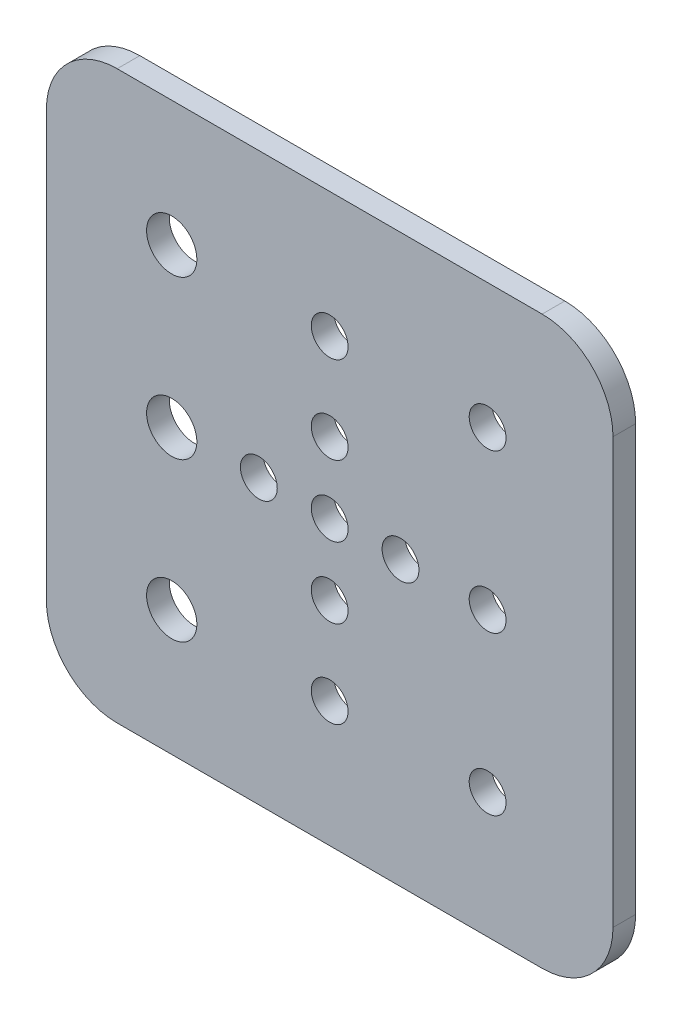
ISO-10303-21;
HEADER;
FILE_DESCRIPTION(('STEP AP214'),'2;1');
FILE_NAME('part.step','',(''),(''),'','','');
FILE_SCHEMA(('AUTOMOTIVE_DESIGN { 1 0 10303 214 1 1 1 1 }'));
ENDSEC;
DATA;
#1=APPLICATION_CONTEXT('core data for automotive mechanical design processes');
#2=APPLICATION_PROTOCOL_DEFINITION('international standard','automotive_design',2000,#1);
#3=PRODUCT_CONTEXT('',#1,'mechanical');
#4=PRODUCT('Part','Part','',(#3));
#5=PRODUCT_RELATED_PRODUCT_CATEGORY('part','',(#4));
#6=PRODUCT_DEFINITION_FORMATION('','',#4);
#7=PRODUCT_DEFINITION_CONTEXT('part definition',#1,'design');
#8=PRODUCT_DEFINITION('design','',#6,#7);
#9=PRODUCT_DEFINITION_SHAPE('','',#8);
#10=(LENGTH_UNIT() NAMED_UNIT(*) SI_UNIT(.MILLI.,.METRE.));
#11=(NAMED_UNIT(*) PLANE_ANGLE_UNIT() SI_UNIT($,.RADIAN.));
#12=(NAMED_UNIT(*) SI_UNIT($,.STERADIAN.) SOLID_ANGLE_UNIT());
#13=UNCERTAINTY_MEASURE_WITH_UNIT(LENGTH_MEASURE(1.E-05),#10,'distance_accuracy_value','');
#14=(GEOMETRIC_REPRESENTATION_CONTEXT(3) GLOBAL_UNCERTAINTY_ASSIGNED_CONTEXT((#13)) GLOBAL_UNIT_ASSIGNED_CONTEXT((#10,
#11,#12)) REPRESENTATION_CONTEXT('',''));
#15=CARTESIAN_POINT('',(0.,0.,0.));
#16=DIRECTION('',(0.,0.,1.));
#17=DIRECTION('',(1.,0.,0.));
#18=AXIS2_PLACEMENT_3D('',#15,#16,#17);
#19=CARTESIAN_POINT('',(0.,0.,3.2));
#20=DIRECTION('',(0.,0.,1.));
#21=DIRECTION('',(1.,0.,0.));
#22=AXIS2_PLACEMENT_3D('',#19,#20,#21);
#23=PLANE('',#22);
#24=CARTESIAN_POINT('',(-22.3,-22.3,3.2));
#25=DIRECTION('',(0.,0.,1.));
#26=DIRECTION('',(1.,0.,0.));
#27=AXIS2_PLACEMENT_3D('',#24,#25,#26);
#28=CIRCLE('',#27,3.55);
#29=CARTESIAN_POINT('',(-18.75,-22.3,3.2));
#30=VERTEX_POINT('',#29);
#31=EDGE_CURVE('E235',#30,#30,#28,.T.);
#32=ORIENTED_EDGE('',*,*,#31,.F.);
#33=EDGE_LOOP('',(#32));
#34=FACE_BOUND('',#33,.T.);
#35=CARTESIAN_POINT('',(22.3,22.3,3.2));
#36=DIRECTION('',(0.,0.,1.));
#37=DIRECTION('',(1.,0.,0.));
#38=AXIS2_PLACEMENT_3D('',#35,#36,#37);
#39=CIRCLE('',#38,2.6);
#40=CARTESIAN_POINT('',(24.9,22.3,3.2));
#41=VERTEX_POINT('',#40);
#42=EDGE_CURVE('E223',#41,#41,#39,.T.);
#43=ORIENTED_EDGE('',*,*,#42,.F.);
#44=EDGE_LOOP('',(#43));
#45=FACE_BOUND('',#44,.T.);
#46=CARTESIAN_POINT('',(-22.3,0.,3.2));
#47=DIRECTION('',(0.,0.,1.));
#48=DIRECTION('',(1.,0.,0.));
#49=AXIS2_PLACEMENT_3D('',#46,#47,#48);
#50=CIRCLE('',#49,3.55);
#51=CARTESIAN_POINT('',(-18.75,0.,3.2));
#52=VERTEX_POINT('',#51);
#53=EDGE_CURVE('E211',#52,#52,#50,.T.);
#54=ORIENTED_EDGE('',*,*,#53,.F.);
#55=EDGE_LOOP('',(#54));
#56=FACE_BOUND('',#55,.T.);
#57=CARTESIAN_POINT('',(10.,0.,3.2));
#58=DIRECTION('',(0.,0.,1.));
#59=DIRECTION('',(1.,0.,0.));
#60=AXIS2_PLACEMENT_3D('',#57,#58,#59);
#61=CIRCLE('',#60,2.6);
#62=CARTESIAN_POINT('',(12.6,0.,3.2));
#63=VERTEX_POINT('',#62);
#64=EDGE_CURVE('E199',#63,#63,#61,.T.);
#65=ORIENTED_EDGE('',*,*,#64,.F.);
#66=EDGE_LOOP('',(#65));
#67=FACE_BOUND('',#66,.T.);
#68=CARTESIAN_POINT('',(0.,-10.,3.2));
#69=DIRECTION('',(0.,0.,1.));
#70=DIRECTION('',(1.,0.,0.));
#71=AXIS2_PLACEMENT_3D('',#68,#69,#70);
#72=CIRCLE('',#71,2.6);
#73=CARTESIAN_POINT('',(2.60000000000001,-10.,3.2));
#74=VERTEX_POINT('',#73);
#75=EDGE_CURVE('E187',#74,#74,#72,.T.);
#76=ORIENTED_EDGE('',*,*,#75,.F.);
#77=EDGE_LOOP('',(#76));
#78=FACE_BOUND('',#77,.T.);
#79=CARTESIAN_POINT('',(0.,10.,3.2));
#80=DIRECTION('',(0.,0.,1.));
#81=DIRECTION('',(1.,0.,0.));
#82=AXIS2_PLACEMENT_3D('',#79,#80,#81);
#83=CIRCLE('',#82,2.6);
#84=CARTESIAN_POINT('',(2.6,10.,3.2));
#85=VERTEX_POINT('',#84);
#86=EDGE_CURVE('E176',#85,#85,#83,.T.);
#87=ORIENTED_EDGE('',*,*,#86,.F.);
#88=EDGE_LOOP('',(#87));
#89=FACE_BOUND('',#88,.T.);
#90=DIRECTION('',(0.,-1.,0.));
#91=VECTOR('',#90,1.);
#92=CARTESIAN_POINT('',(-40.,40.,3.2));
#93=LINE('',#92,#91);
#94=CARTESIAN_POINT('',(-40.,30.,3.2));
#95=VERTEX_POINT('',#94);
#96=CARTESIAN_POINT('',(-40.,-30.,3.2));
#97=VERTEX_POINT('',#96);
#98=EDGE_CURVE('E171',#95,#97,#93,.T.);
#99=ORIENTED_EDGE('',*,*,#98,.T.);
#100=CARTESIAN_POINT('',(-30.,-30.,3.2));
#101=DIRECTION('',(0.,0.,1.));
#102=DIRECTION('',(1.,0.,0.));
#103=AXIS2_PLACEMENT_3D('',#100,#101,#102);
#104=CIRCLE('',#103,10.);
#105=CARTESIAN_POINT('',(-30.,-40.,3.2));
#106=VERTEX_POINT('',#105);
#107=EDGE_CURVE('E148',#97,#106,#104,.T.);
#108=ORIENTED_EDGE('',*,*,#107,.T.);
#109=DIRECTION('',(1.,0.,0.));
#110=VECTOR('',#109,1.);
#111=CARTESIAN_POINT('',(-40.,-40.,3.2));
#112=LINE('',#111,#110);
#113=CARTESIAN_POINT('',(30.,-40.,3.2));
#114=VERTEX_POINT('',#113);
#115=EDGE_CURVE('E119',#106,#114,#112,.T.);
#116=ORIENTED_EDGE('',*,*,#115,.T.);
#117=CARTESIAN_POINT('',(30.,-30.,3.2));
#118=DIRECTION('',(0.,0.,1.));
#119=DIRECTION('',(1.,0.,0.));
#120=AXIS2_PLACEMENT_3D('',#117,#118,#119);
#121=CIRCLE('',#120,10.);
#122=CARTESIAN_POINT('',(40.,-30.,3.2));
#123=VERTEX_POINT('',#122);
#124=EDGE_CURVE('E146',#114,#123,#121,.T.);
#125=ORIENTED_EDGE('',*,*,#124,.T.);
#126=DIRECTION('',(0.,1.,0.));
#127=VECTOR('',#126,1.);
#128=CARTESIAN_POINT('',(40.,40.,3.2));
#129=LINE('',#128,#127);
#130=CARTESIAN_POINT('',(40.,30.,3.2));
#131=VERTEX_POINT('',#130);
#132=EDGE_CURVE('E126',#123,#131,#129,.T.);
#133=ORIENTED_EDGE('',*,*,#132,.T.);
#134=CARTESIAN_POINT('',(30.,30.,3.2));
#135=DIRECTION('',(0.,0.,1.));
#136=DIRECTION('',(1.,0.,0.));
#137=AXIS2_PLACEMENT_3D('',#134,#135,#136);
#138=CIRCLE('',#137,10.);
#139=CARTESIAN_POINT('',(30.,40.,3.2));
#140=VERTEX_POINT('',#139);
#141=EDGE_CURVE('E54',#131,#140,#138,.T.);
#142=ORIENTED_EDGE('',*,*,#141,.T.);
#143=DIRECTION('',(-1.,0.,0.));
#144=VECTOR('',#143,1.);
#145=CARTESIAN_POINT('',(-40.,40.,3.2));
#146=LINE('',#145,#144);
#147=CARTESIAN_POINT('',(-30.,40.,3.2));
#148=VERTEX_POINT('',#147);
#149=EDGE_CURVE('E129',#140,#148,#146,.T.);
#150=ORIENTED_EDGE('',*,*,#149,.T.);
#151=CARTESIAN_POINT('',(-30.,30.,3.2));
#152=DIRECTION('',(0.,0.,1.));
#153=DIRECTION('',(1.,0.,0.));
#154=AXIS2_PLACEMENT_3D('',#151,#152,#153);
#155=CIRCLE('',#154,10.);
#156=EDGE_CURVE('E143',#148,#95,#155,.T.);
#157=ORIENTED_EDGE('',*,*,#156,.T.);
#158=EDGE_LOOP('',(#99,#108,#116,#125,#133,#142,#150,#157));
#159=FACE_BOUND('',#158,.T.);
#160=CARTESIAN_POINT('',(0.,0.,3.2));
#161=DIRECTION('',(0.,0.,1.));
#162=DIRECTION('',(1.,0.,0.));
#163=AXIS2_PLACEMENT_3D('',#160,#161,#162);
#164=CIRCLE('',#163,2.6);
#165=CARTESIAN_POINT('',(2.59999999999999,0.,3.2));
#166=VERTEX_POINT('',#165);
#167=EDGE_CURVE('E164',#166,#166,#164,.T.);
#168=ORIENTED_EDGE('',*,*,#167,.F.);
#169=EDGE_LOOP('',(#168));
#170=FACE_BOUND('',#169,.T.);
#171=CARTESIAN_POINT('',(0.,22.3,3.2));
#172=DIRECTION('',(0.,0.,1.));
#173=DIRECTION('',(1.,0.,0.));
#174=AXIS2_PLACEMENT_3D('',#171,#172,#173);
#175=CIRCLE('',#174,2.6);
#176=CARTESIAN_POINT('',(2.6,22.3,3.2));
#177=VERTEX_POINT('',#176);
#178=EDGE_CURVE('E181',#177,#177,#175,.T.);
#179=ORIENTED_EDGE('',*,*,#178,.F.);
#180=EDGE_LOOP('',(#179));
#181=FACE_BOUND('',#180,.T.);
#182=CARTESIAN_POINT('',(0.,-22.3,3.2));
#183=DIRECTION('',(0.,0.,1.));
#184=DIRECTION('',(1.,0.,0.));
#185=AXIS2_PLACEMENT_3D('',#182,#183,#184);
#186=CIRCLE('',#185,2.6);
#187=CARTESIAN_POINT('',(2.60000000000001,-22.3,3.2));
#188=VERTEX_POINT('',#187);
#189=EDGE_CURVE('E193',#188,#188,#186,.T.);
#190=ORIENTED_EDGE('',*,*,#189,.F.);
#191=EDGE_LOOP('',(#190));
#192=FACE_BOUND('',#191,.T.);
#193=CARTESIAN_POINT('',(-10.,0.,3.2));
#194=DIRECTION('',(0.,0.,1.));
#195=DIRECTION('',(1.,0.,0.));
#196=AXIS2_PLACEMENT_3D('',#193,#194,#195);
#197=CIRCLE('',#196,2.6);
#198=CARTESIAN_POINT('',(-7.4,0.,3.2));
#199=VERTEX_POINT('',#198);
#200=EDGE_CURVE('E205',#199,#199,#197,.T.);
#201=ORIENTED_EDGE('',*,*,#200,.F.);
#202=EDGE_LOOP('',(#201));
#203=FACE_BOUND('',#202,.T.);
#204=CARTESIAN_POINT('',(22.3,0.,3.2));
#205=DIRECTION('',(0.,0.,1.));
#206=DIRECTION('',(1.,0.,0.));
#207=AXIS2_PLACEMENT_3D('',#204,#205,#206);
#208=CIRCLE('',#207,2.6);
#209=CARTESIAN_POINT('',(24.9,0.,3.2));
#210=VERTEX_POINT('',#209);
#211=EDGE_CURVE('E217',#210,#210,#208,.T.);
#212=ORIENTED_EDGE('',*,*,#211,.F.);
#213=EDGE_LOOP('',(#212));
#214=FACE_BOUND('',#213,.T.);
#215=CARTESIAN_POINT('',(22.3,-22.3,3.2));
#216=DIRECTION('',(0.,0.,1.));
#217=DIRECTION('',(1.,0.,0.));
#218=AXIS2_PLACEMENT_3D('',#215,#216,#217);
#219=CIRCLE('',#218,2.6);
#220=CARTESIAN_POINT('',(24.9,-22.3,3.2));
#221=VERTEX_POINT('',#220);
#222=EDGE_CURVE('E229',#221,#221,#219,.T.);
#223=ORIENTED_EDGE('',*,*,#222,.F.);
#224=EDGE_LOOP('',(#223));
#225=FACE_BOUND('',#224,.T.);
#226=CARTESIAN_POINT('',(-22.3,22.3,3.2));
#227=DIRECTION('',(0.,0.,1.));
#228=DIRECTION('',(1.,0.,0.));
#229=AXIS2_PLACEMENT_3D('',#226,#227,#228);
#230=CIRCLE('',#229,3.55);
#231=CARTESIAN_POINT('',(-18.75,22.3,3.2));
#232=VERTEX_POINT('',#231);
#233=EDGE_CURVE('E241',#232,#232,#230,.T.);
#234=ORIENTED_EDGE('',*,*,#233,.F.);
#235=EDGE_LOOP('',(#234));
#236=FACE_BOUND('',#235,.T.);
#237=ADVANCED_FACE('F33',(#34,#45,#56,#67,#78,#89,#159,#170,#181,#192,#203,#214,#225,#236),#23,.T.);
#238=CARTESIAN_POINT('',(0.,0.,0.));
#239=DIRECTION('',(0.,0.,1.));
#240=DIRECTION('',(1.,0.,0.));
#241=AXIS2_PLACEMENT_3D('',#238,#239,#240);
#242=PLANE('',#241);
#243=CARTESIAN_POINT('',(-22.3,-22.3,0.));
#244=DIRECTION('',(0.,0.,1.));
#245=DIRECTION('',(1.,0.,0.));
#246=AXIS2_PLACEMENT_3D('',#243,#244,#245);
#247=CIRCLE('',#246,3.55);
#248=CARTESIAN_POINT('',(-18.75,-22.3,0.));
#249=VERTEX_POINT('',#248);
#250=EDGE_CURVE('E238',#249,#249,#247,.T.);
#251=ORIENTED_EDGE('',*,*,#250,.T.);
#252=EDGE_LOOP('',(#251));
#253=FACE_BOUND('',#252,.T.);
#254=CARTESIAN_POINT('',(22.3,22.3,0.));
#255=DIRECTION('',(0.,0.,1.));
#256=DIRECTION('',(1.,0.,0.));
#257=AXIS2_PLACEMENT_3D('',#254,#255,#256);
#258=CIRCLE('',#257,2.6);
#259=CARTESIAN_POINT('',(24.9,22.3,0.));
#260=VERTEX_POINT('',#259);
#261=EDGE_CURVE('E226',#260,#260,#258,.T.);
#262=ORIENTED_EDGE('',*,*,#261,.T.);
#263=EDGE_LOOP('',(#262));
#264=FACE_BOUND('',#263,.T.);
#265=CARTESIAN_POINT('',(-22.3,0.,0.));
#266=DIRECTION('',(0.,0.,1.));
#267=DIRECTION('',(1.,0.,0.));
#268=AXIS2_PLACEMENT_3D('',#265,#266,#267);
#269=CIRCLE('',#268,3.55);
#270=CARTESIAN_POINT('',(-18.75,0.,0.));
#271=VERTEX_POINT('',#270);
#272=EDGE_CURVE('E214',#271,#271,#269,.T.);
#273=ORIENTED_EDGE('',*,*,#272,.T.);
#274=EDGE_LOOP('',(#273));
#275=FACE_BOUND('',#274,.T.);
#276=CARTESIAN_POINT('',(10.,0.,0.));
#277=DIRECTION('',(0.,0.,1.));
#278=DIRECTION('',(1.,0.,0.));
#279=AXIS2_PLACEMENT_3D('',#276,#277,#278);
#280=CIRCLE('',#279,2.6);
#281=CARTESIAN_POINT('',(12.6,0.,0.));
#282=VERTEX_POINT('',#281);
#283=EDGE_CURVE('E202',#282,#282,#280,.T.);
#284=ORIENTED_EDGE('',*,*,#283,.T.);
#285=EDGE_LOOP('',(#284));
#286=FACE_BOUND('',#285,.T.);
#287=CARTESIAN_POINT('',(0.,-10.,0.));
#288=DIRECTION('',(0.,0.,1.));
#289=DIRECTION('',(1.,0.,0.));
#290=AXIS2_PLACEMENT_3D('',#287,#288,#289);
#291=CIRCLE('',#290,2.6);
#292=CARTESIAN_POINT('',(2.60000000000001,-10.,0.));
#293=VERTEX_POINT('',#292);
#294=EDGE_CURVE('E190',#293,#293,#291,.T.);
#295=ORIENTED_EDGE('',*,*,#294,.T.);
#296=EDGE_LOOP('',(#295));
#297=FACE_BOUND('',#296,.T.);
#298=CARTESIAN_POINT('',(0.,10.,0.));
#299=DIRECTION('',(0.,0.,1.));
#300=DIRECTION('',(1.,0.,0.));
#301=AXIS2_PLACEMENT_3D('',#298,#299,#300);
#302=CIRCLE('',#301,2.6);
#303=CARTESIAN_POINT('',(2.6,10.,0.));
#304=VERTEX_POINT('',#303);
#305=EDGE_CURVE('E178',#304,#304,#302,.T.);
#306=ORIENTED_EDGE('',*,*,#305,.T.);
#307=EDGE_LOOP('',(#306));
#308=FACE_BOUND('',#307,.T.);
#309=DIRECTION('',(1.,0.,0.));
#310=VECTOR('',#309,1.);
#311=CARTESIAN_POINT('',(-40.,-40.,0.));
#312=LINE('',#311,#310);
#313=CARTESIAN_POINT('',(-30.,-40.,0.));
#314=VERTEX_POINT('',#313);
#315=CARTESIAN_POINT('',(30.,-40.,0.));
#316=VERTEX_POINT('',#315);
#317=EDGE_CURVE('E116',#314,#316,#312,.T.);
#318=ORIENTED_EDGE('',*,*,#317,.F.);
#319=CARTESIAN_POINT('',(-30.,-30.,0.));
#320=DIRECTION('',(0.,0.,1.));
#321=DIRECTION('',(1.,0.,0.));
#322=AXIS2_PLACEMENT_3D('',#319,#320,#321);
#323=CIRCLE('',#322,10.);
#324=CARTESIAN_POINT('',(-40.,-30.,0.));
#325=VERTEX_POINT('',#324);
#326=EDGE_CURVE('E99',#314,#325,#323,.F.);
#327=ORIENTED_EDGE('',*,*,#326,.T.);
#328=DIRECTION('',(0.,-1.,0.));
#329=VECTOR('',#328,1.);
#330=CARTESIAN_POINT('',(-40.,40.,0.));
#331=LINE('',#330,#329);
#332=CARTESIAN_POINT('',(-40.,30.,0.));
#333=VERTEX_POINT('',#332);
#334=EDGE_CURVE('E127',#333,#325,#331,.T.);
#335=ORIENTED_EDGE('',*,*,#334,.F.);
#336=CARTESIAN_POINT('',(-30.,30.,0.));
#337=DIRECTION('',(0.,0.,1.));
#338=DIRECTION('',(1.,0.,0.));
#339=AXIS2_PLACEMENT_3D('',#336,#337,#338);
#340=CIRCLE('',#339,10.);
#341=CARTESIAN_POINT('',(-30.,40.,0.));
#342=VERTEX_POINT('',#341);
#343=EDGE_CURVE('E120',#333,#342,#340,.F.);
#344=ORIENTED_EDGE('',*,*,#343,.T.);
#345=DIRECTION('',(-1.,0.,0.));
#346=VECTOR('',#345,1.);
#347=CARTESIAN_POINT('',(-40.,40.,0.));
#348=LINE('',#347,#346);
#349=CARTESIAN_POINT('',(30.,40.,0.));
#350=VERTEX_POINT('',#349);
#351=EDGE_CURVE('E131',#350,#342,#348,.T.);
#352=ORIENTED_EDGE('',*,*,#351,.F.);
#353=CARTESIAN_POINT('',(30.,30.,0.));
#354=DIRECTION('',(0.,0.,1.));
#355=DIRECTION('',(1.,0.,0.));
#356=AXIS2_PLACEMENT_3D('',#353,#354,#355);
#357=CIRCLE('',#356,10.);
#358=CARTESIAN_POINT('',(40.,30.,0.));
#359=VERTEX_POINT('',#358);
#360=EDGE_CURVE('E137',#350,#359,#357,.F.);
#361=ORIENTED_EDGE('',*,*,#360,.T.);
#362=DIRECTION('',(0.,1.,0.));
#363=VECTOR('',#362,1.);
#364=CARTESIAN_POINT('',(40.,40.,0.));
#365=LINE('',#364,#363);
#366=CARTESIAN_POINT('',(40.,-30.,0.));
#367=VERTEX_POINT('',#366);
#368=EDGE_CURVE('E159',#367,#359,#365,.T.);
#369=ORIENTED_EDGE('',*,*,#368,.F.);
#370=CARTESIAN_POINT('',(30.,-30.,0.));
#371=DIRECTION('',(0.,0.,1.));
#372=DIRECTION('',(1.,0.,0.));
#373=AXIS2_PLACEMENT_3D('',#370,#371,#372);
#374=CIRCLE('',#373,10.);
#375=EDGE_CURVE('E110',#367,#316,#374,.F.);
#376=ORIENTED_EDGE('',*,*,#375,.T.);
#377=EDGE_LOOP('',(#318,#327,#335,#344,#352,#361,#369,#376));
#378=FACE_BOUND('',#377,.T.);
#379=CARTESIAN_POINT('',(0.,0.,0.));
#380=DIRECTION('',(0.,0.,1.));
#381=DIRECTION('',(1.,0.,0.));
#382=AXIS2_PLACEMENT_3D('',#379,#380,#381);
#383=CIRCLE('',#382,2.6);
#384=CARTESIAN_POINT('',(2.59999999999999,0.,0.));
#385=VERTEX_POINT('',#384);
#386=EDGE_CURVE('E167',#385,#385,#383,.T.);
#387=ORIENTED_EDGE('',*,*,#386,.T.);
#388=EDGE_LOOP('',(#387));
#389=FACE_BOUND('',#388,.T.);
#390=CARTESIAN_POINT('',(0.,22.3,0.));
#391=DIRECTION('',(0.,0.,1.));
#392=DIRECTION('',(1.,0.,0.));
#393=AXIS2_PLACEMENT_3D('',#390,#391,#392);
#394=CIRCLE('',#393,2.6);
#395=CARTESIAN_POINT('',(2.6,22.3,0.));
#396=VERTEX_POINT('',#395);
#397=EDGE_CURVE('E184',#396,#396,#394,.T.);
#398=ORIENTED_EDGE('',*,*,#397,.T.);
#399=EDGE_LOOP('',(#398));
#400=FACE_BOUND('',#399,.T.);
#401=CARTESIAN_POINT('',(0.,-22.3,0.));
#402=DIRECTION('',(0.,0.,1.));
#403=DIRECTION('',(1.,0.,0.));
#404=AXIS2_PLACEMENT_3D('',#401,#402,#403);
#405=CIRCLE('',#404,2.6);
#406=CARTESIAN_POINT('',(2.60000000000001,-22.3,0.));
#407=VERTEX_POINT('',#406);
#408=EDGE_CURVE('E196',#407,#407,#405,.T.);
#409=ORIENTED_EDGE('',*,*,#408,.T.);
#410=EDGE_LOOP('',(#409));
#411=FACE_BOUND('',#410,.T.);
#412=CARTESIAN_POINT('',(-10.,0.,0.));
#413=DIRECTION('',(0.,0.,1.));
#414=DIRECTION('',(1.,0.,0.));
#415=AXIS2_PLACEMENT_3D('',#412,#413,#414);
#416=CIRCLE('',#415,2.6);
#417=CARTESIAN_POINT('',(-7.4,0.,0.));
#418=VERTEX_POINT('',#417);
#419=EDGE_CURVE('E208',#418,#418,#416,.T.);
#420=ORIENTED_EDGE('',*,*,#419,.T.);
#421=EDGE_LOOP('',(#420));
#422=FACE_BOUND('',#421,.T.);
#423=CARTESIAN_POINT('',(22.3,0.,0.));
#424=DIRECTION('',(0.,0.,1.));
#425=DIRECTION('',(1.,0.,0.));
#426=AXIS2_PLACEMENT_3D('',#423,#424,#425);
#427=CIRCLE('',#426,2.6);
#428=CARTESIAN_POINT('',(24.9,0.,0.));
#429=VERTEX_POINT('',#428);
#430=EDGE_CURVE('E220',#429,#429,#427,.T.);
#431=ORIENTED_EDGE('',*,*,#430,.T.);
#432=EDGE_LOOP('',(#431));
#433=FACE_BOUND('',#432,.T.);
#434=CARTESIAN_POINT('',(22.3,-22.3,0.));
#435=DIRECTION('',(0.,0.,1.));
#436=DIRECTION('',(1.,0.,0.));
#437=AXIS2_PLACEMENT_3D('',#434,#435,#436);
#438=CIRCLE('',#437,2.6);
#439=CARTESIAN_POINT('',(24.9,-22.3,0.));
#440=VERTEX_POINT('',#439);
#441=EDGE_CURVE('E232',#440,#440,#438,.T.);
#442=ORIENTED_EDGE('',*,*,#441,.T.);
#443=EDGE_LOOP('',(#442));
#444=FACE_BOUND('',#443,.T.);
#445=CARTESIAN_POINT('',(-22.3,22.3,0.));
#446=DIRECTION('',(0.,0.,1.));
#447=DIRECTION('',(1.,0.,0.));
#448=AXIS2_PLACEMENT_3D('',#445,#446,#447);
#449=CIRCLE('',#448,3.55);
#450=CARTESIAN_POINT('',(-18.75,22.3,0.));
#451=VERTEX_POINT('',#450);
#452=EDGE_CURVE('E244',#451,#451,#449,.T.);
#453=ORIENTED_EDGE('',*,*,#452,.T.);
#454=EDGE_LOOP('',(#453));
#455=FACE_BOUND('',#454,.T.);
#456=ADVANCED_FACE('F123',(#253,#264,#275,#286,#297,#308,#378,#389,#400,#411,#422,#433,#444,
#455),#242,.F.);
#457=CARTESIAN_POINT('',(40.,40.,3.2));
#458=DIRECTION('',(-1.,0.,0.));
#459=DIRECTION('',(0.,-1.,0.));
#460=AXIS2_PLACEMENT_3D('',#457,#458,#459);
#461=PLANE('',#460);
#462=ORIENTED_EDGE('',*,*,#132,.F.);
#463=DIRECTION('',(0.,0.,-1.));
#464=VECTOR('',#463,1.);
#465=CARTESIAN_POINT('',(40.,-30.,3.2));
#466=LINE('',#465,#464);
#467=EDGE_CURVE('E152',#123,#367,#466,.T.);
#468=ORIENTED_EDGE('',*,*,#467,.T.);
#469=ORIENTED_EDGE('',*,*,#368,.T.);
#470=DIRECTION('',(0.,0.,-1.));
#471=VECTOR('',#470,1.);
#472=CARTESIAN_POINT('',(40.,30.,3.2));
#473=LINE('',#472,#471);
#474=EDGE_CURVE('E150',#359,#131,#473,.F.);
#475=ORIENTED_EDGE('',*,*,#474,.T.);
#476=EDGE_LOOP('',(#462,#468,#469,#475));
#477=FACE_BOUND('',#476,.T.);
#478=ADVANCED_FACE('F158',(#477),#461,.F.);
#479=CARTESIAN_POINT('',(-40.,40.,3.2));
#480=DIRECTION('',(0.,-1.,0.));
#481=DIRECTION('',(0.,0.,-1.));
#482=AXIS2_PLACEMENT_3D('',#479,#480,#481);
#483=PLANE('',#482);
#484=ORIENTED_EDGE('',*,*,#149,.F.);
#485=DIRECTION('',(0.,0.,-1.));
#486=VECTOR('',#485,1.);
#487=CARTESIAN_POINT('',(30.,40.,3.2));
#488=LINE('',#487,#486);
#489=EDGE_CURVE('E11',#140,#350,#488,.T.);
#490=ORIENTED_EDGE('',*,*,#489,.T.);
#491=ORIENTED_EDGE('',*,*,#351,.T.);
#492=DIRECTION('',(0.,0.,-1.));
#493=VECTOR('',#492,1.);
#494=CARTESIAN_POINT('',(-30.,40.,3.2));
#495=LINE('',#494,#493);
#496=EDGE_CURVE('E41',#342,#148,#495,.F.);
#497=ORIENTED_EDGE('',*,*,#496,.T.);
#498=EDGE_LOOP('',(#484,#490,#491,#497));
#499=FACE_BOUND('',#498,.T.);
#500=ADVANCED_FACE('F272',(#499),#483,.F.);
#501=CARTESIAN_POINT('',(-40.,40.,3.2));
#502=DIRECTION('',(1.,0.,0.));
#503=DIRECTION('',(0.,1.,0.));
#504=AXIS2_PLACEMENT_3D('',#501,#502,#503);
#505=PLANE('',#504);
#506=ORIENTED_EDGE('',*,*,#334,.T.);
#507=DIRECTION('',(0.,0.,-1.));
#508=VECTOR('',#507,1.);
#509=CARTESIAN_POINT('',(-40.,-30.,3.2));
#510=LINE('',#509,#508);
#511=EDGE_CURVE('E104',#325,#97,#510,.F.);
#512=ORIENTED_EDGE('',*,*,#511,.T.);
#513=ORIENTED_EDGE('',*,*,#98,.F.);
#514=DIRECTION('',(0.,0.,-1.));
#515=VECTOR('',#514,1.);
#516=CARTESIAN_POINT('',(-40.,30.,3.2));
#517=LINE('',#516,#515);
#518=EDGE_CURVE('E109',#95,#333,#517,.T.);
#519=ORIENTED_EDGE('',*,*,#518,.T.);
#520=EDGE_LOOP('',(#506,#512,#513,#519));
#521=FACE_BOUND('',#520,.T.);
#522=ADVANCED_FACE('F269',(#521),#505,.F.);
#523=CARTESIAN_POINT('',(-40.,-40.,3.2));
#524=DIRECTION('',(0.,1.,0.));
#525=DIRECTION('',(0.,0.,1.));
#526=AXIS2_PLACEMENT_3D('',#523,#524,#525);
#527=PLANE('',#526);
#528=ORIENTED_EDGE('',*,*,#115,.F.);
#529=DIRECTION('',(0.,0.,-1.));
#530=VECTOR('',#529,1.);
#531=CARTESIAN_POINT('',(-30.,-40.,3.2));
#532=LINE('',#531,#530);
#533=EDGE_CURVE('E103',#106,#314,#532,.T.);
#534=ORIENTED_EDGE('',*,*,#533,.T.);
#535=ORIENTED_EDGE('',*,*,#317,.T.);
#536=DIRECTION('',(0.,0.,-1.));
#537=VECTOR('',#536,1.);
#538=CARTESIAN_POINT('',(30.,-40.,3.2));
#539=LINE('',#538,#537);
#540=EDGE_CURVE('E121',#316,#114,#539,.F.);
#541=ORIENTED_EDGE('',*,*,#540,.T.);
#542=EDGE_LOOP('',(#528,#534,#535,#541));
#543=FACE_BOUND('',#542,.T.);
#544=ADVANCED_FACE('F115',(#543),#527,.F.);
#545=CARTESIAN_POINT('',(0.,0.,3.2));
#546=DIRECTION('',(0.,0.,-1.));
#547=DIRECTION('',(-1.,0.,0.));
#548=AXIS2_PLACEMENT_3D('',#545,#546,#547);
#549=CYLINDRICAL_SURFACE('',#548,2.6);
#550=ORIENTED_EDGE('',*,*,#167,.T.);
#551=EDGE_LOOP('',(#550));
#552=FACE_BOUND('',#551,.T.);
#553=ORIENTED_EDGE('',*,*,#386,.F.);
#554=EDGE_LOOP('',(#553));
#555=FACE_BOUND('',#554,.T.);
#556=ADVANCED_FACE('F264',(#552,#555),#549,.F.);
#557=CARTESIAN_POINT('',(0.,10.,3.2));
#558=DIRECTION('',(0.,0.,-1.));
#559=DIRECTION('',(-1.,0.,0.));
#560=AXIS2_PLACEMENT_3D('',#557,#558,#559);
#561=CYLINDRICAL_SURFACE('',#560,2.6);
#562=ORIENTED_EDGE('',*,*,#86,.T.);
#563=EDGE_LOOP('',(#562));
#564=FACE_BOUND('',#563,.T.);
#565=ORIENTED_EDGE('',*,*,#305,.F.);
#566=EDGE_LOOP('',(#565));
#567=FACE_BOUND('',#566,.T.);
#568=ADVANCED_FACE('F353',(#564,#567),#561,.F.);
#569=CARTESIAN_POINT('',(0.,22.3,3.2));
#570=DIRECTION('',(0.,0.,-1.));
#571=DIRECTION('',(-1.,0.,0.));
#572=AXIS2_PLACEMENT_3D('',#569,#570,#571);
#573=CYLINDRICAL_SURFACE('',#572,2.6);
#574=ORIENTED_EDGE('',*,*,#178,.T.);
#575=EDGE_LOOP('',(#574));
#576=FACE_BOUND('',#575,.T.);
#577=ORIENTED_EDGE('',*,*,#397,.F.);
#578=EDGE_LOOP('',(#577));
#579=FACE_BOUND('',#578,.T.);
#580=ADVANCED_FACE('F350',(#576,#579),#573,.F.);
#581=CARTESIAN_POINT('',(0.,-10.,3.2));
#582=DIRECTION('',(0.,0.,-1.));
#583=DIRECTION('',(-1.,0.,0.));
#584=AXIS2_PLACEMENT_3D('',#581,#582,#583);
#585=CYLINDRICAL_SURFACE('',#584,2.6);
#586=ORIENTED_EDGE('',*,*,#75,.T.);
#587=EDGE_LOOP('',(#586));
#588=FACE_BOUND('',#587,.T.);
#589=ORIENTED_EDGE('',*,*,#294,.F.);
#590=EDGE_LOOP('',(#589));
#591=FACE_BOUND('',#590,.T.);
#592=ADVANCED_FACE('F346',(#588,#591),#585,.F.);
#593=CARTESIAN_POINT('',(0.,-22.3,3.2));
#594=DIRECTION('',(0.,0.,-1.));
#595=DIRECTION('',(-1.,0.,0.));
#596=AXIS2_PLACEMENT_3D('',#593,#594,#595);
#597=CYLINDRICAL_SURFACE('',#596,2.6);
#598=ORIENTED_EDGE('',*,*,#189,.T.);
#599=EDGE_LOOP('',(#598));
#600=FACE_BOUND('',#599,.T.);
#601=ORIENTED_EDGE('',*,*,#408,.F.);
#602=EDGE_LOOP('',(#601));
#603=FACE_BOUND('',#602,.T.);
#604=ADVANCED_FACE('F342',(#600,#603),#597,.F.);
#605=CARTESIAN_POINT('',(10.,0.,3.2));
#606=DIRECTION('',(0.,0.,-1.));
#607=DIRECTION('',(-1.,0.,0.));
#608=AXIS2_PLACEMENT_3D('',#605,#606,#607);
#609=CYLINDRICAL_SURFACE('',#608,2.6);
#610=ORIENTED_EDGE('',*,*,#64,.T.);
#611=EDGE_LOOP('',(#610));
#612=FACE_BOUND('',#611,.T.);
#613=ORIENTED_EDGE('',*,*,#283,.F.);
#614=EDGE_LOOP('',(#613));
#615=FACE_BOUND('',#614,.T.);
#616=ADVANCED_FACE('F338',(#612,#615),#609,.F.);
#617=CARTESIAN_POINT('',(-10.,0.,3.2));
#618=DIRECTION('',(0.,0.,-1.));
#619=DIRECTION('',(-1.,0.,0.));
#620=AXIS2_PLACEMENT_3D('',#617,#618,#619);
#621=CYLINDRICAL_SURFACE('',#620,2.6);
#622=ORIENTED_EDGE('',*,*,#200,.T.);
#623=EDGE_LOOP('',(#622));
#624=FACE_BOUND('',#623,.T.);
#625=ORIENTED_EDGE('',*,*,#419,.F.);
#626=EDGE_LOOP('',(#625));
#627=FACE_BOUND('',#626,.T.);
#628=ADVANCED_FACE('F334',(#624,#627),#621,.F.);
#629=CARTESIAN_POINT('',(-22.3,0.,3.2));
#630=DIRECTION('',(0.,0.,-1.));
#631=DIRECTION('',(-1.,0.,0.));
#632=AXIS2_PLACEMENT_3D('',#629,#630,#631);
#633=CYLINDRICAL_SURFACE('',#632,3.55);
#634=ORIENTED_EDGE('',*,*,#53,.T.);
#635=EDGE_LOOP('',(#634));
#636=FACE_BOUND('',#635,.T.);
#637=ORIENTED_EDGE('',*,*,#272,.F.);
#638=EDGE_LOOP('',(#637));
#639=FACE_BOUND('',#638,.T.);
#640=ADVANCED_FACE('F330',(#636,#639),#633,.F.);
#641=CARTESIAN_POINT('',(22.3,0.,3.2));
#642=DIRECTION('',(0.,0.,-1.));
#643=DIRECTION('',(-1.,0.,0.));
#644=AXIS2_PLACEMENT_3D('',#641,#642,#643);
#645=CYLINDRICAL_SURFACE('',#644,2.6);
#646=ORIENTED_EDGE('',*,*,#211,.T.);
#647=EDGE_LOOP('',(#646));
#648=FACE_BOUND('',#647,.T.);
#649=ORIENTED_EDGE('',*,*,#430,.F.);
#650=EDGE_LOOP('',(#649));
#651=FACE_BOUND('',#650,.T.);
#652=ADVANCED_FACE('F326',(#648,#651),#645,.F.);
#653=CARTESIAN_POINT('',(22.3,22.3,3.2));
#654=DIRECTION('',(0.,0.,-1.));
#655=DIRECTION('',(-1.,0.,0.));
#656=AXIS2_PLACEMENT_3D('',#653,#654,#655);
#657=CYLINDRICAL_SURFACE('',#656,2.6);
#658=ORIENTED_EDGE('',*,*,#42,.T.);
#659=EDGE_LOOP('',(#658));
#660=FACE_BOUND('',#659,.T.);
#661=ORIENTED_EDGE('',*,*,#261,.F.);
#662=EDGE_LOOP('',(#661));
#663=FACE_BOUND('',#662,.T.);
#664=ADVANCED_FACE('F310',(#660,#663),#657,.F.);
#665=CARTESIAN_POINT('',(22.3,-22.3,3.2));
#666=DIRECTION('',(0.,0.,-1.));
#667=DIRECTION('',(-1.,0.,0.));
#668=AXIS2_PLACEMENT_3D('',#665,#666,#667);
#669=CYLINDRICAL_SURFACE('',#668,2.6);
#670=ORIENTED_EDGE('',*,*,#222,.T.);
#671=EDGE_LOOP('',(#670));
#672=FACE_BOUND('',#671,.T.);
#673=ORIENTED_EDGE('',*,*,#441,.F.);
#674=EDGE_LOOP('',(#673));
#675=FACE_BOUND('',#674,.T.);
#676=ADVANCED_FACE('F306',(#672,#675),#669,.F.);
#677=CARTESIAN_POINT('',(-22.3,-22.3,3.2));
#678=DIRECTION('',(0.,0.,-1.));
#679=DIRECTION('',(-1.,0.,0.));
#680=AXIS2_PLACEMENT_3D('',#677,#678,#679);
#681=CYLINDRICAL_SURFACE('',#680,3.55);
#682=ORIENTED_EDGE('',*,*,#31,.T.);
#683=EDGE_LOOP('',(#682));
#684=FACE_BOUND('',#683,.T.);
#685=ORIENTED_EDGE('',*,*,#250,.F.);
#686=EDGE_LOOP('',(#685));
#687=FACE_BOUND('',#686,.T.);
#688=ADVANCED_FACE('F309',(#684,#687),#681,.F.);
#689=CARTESIAN_POINT('',(-22.3,22.3,3.2));
#690=DIRECTION('',(0.,0.,-1.));
#691=DIRECTION('',(-1.,0.,0.));
#692=AXIS2_PLACEMENT_3D('',#689,#690,#691);
#693=CYLINDRICAL_SURFACE('',#692,3.55);
#694=ORIENTED_EDGE('',*,*,#233,.T.);
#695=EDGE_LOOP('',(#694));
#696=FACE_BOUND('',#695,.T.);
#697=ORIENTED_EDGE('',*,*,#452,.F.);
#698=EDGE_LOOP('',(#697));
#699=FACE_BOUND('',#698,.T.);
#700=ADVANCED_FACE('F250',(#696,#699),#693,.F.);
#701=CARTESIAN_POINT('',(-30.,-30.,3.2));
#702=DIRECTION('',(0.,0.,-1.));
#703=DIRECTION('',(-1.,0.,0.));
#704=AXIS2_PLACEMENT_3D('',#701,#702,#703);
#705=CYLINDRICAL_SURFACE('',#704,10.);
#706=ORIENTED_EDGE('',*,*,#107,.F.);
#707=ORIENTED_EDGE('',*,*,#511,.F.);
#708=ORIENTED_EDGE('',*,*,#326,.F.);
#709=ORIENTED_EDGE('',*,*,#533,.F.);
#710=EDGE_LOOP('',(#706,#707,#708,#709));
#711=FACE_BOUND('',#710,.T.);
#712=ADVANCED_FACE('F102',(#711),#705,.T.);
#713=CARTESIAN_POINT('',(30.,-30.,3.2));
#714=DIRECTION('',(0.,0.,-1.));
#715=DIRECTION('',(-1.,0.,0.));
#716=AXIS2_PLACEMENT_3D('',#713,#714,#715);
#717=CYLINDRICAL_SURFACE('',#716,10.);
#718=ORIENTED_EDGE('',*,*,#124,.F.);
#719=ORIENTED_EDGE('',*,*,#540,.F.);
#720=ORIENTED_EDGE('',*,*,#375,.F.);
#721=ORIENTED_EDGE('',*,*,#467,.F.);
#722=EDGE_LOOP('',(#718,#719,#720,#721));
#723=FACE_BOUND('',#722,.T.);
#724=ADVANCED_FACE('F280',(#723),#717,.T.);
#725=CARTESIAN_POINT('',(30.,30.,3.2));
#726=DIRECTION('',(0.,0.,-1.));
#727=DIRECTION('',(-1.,0.,0.));
#728=AXIS2_PLACEMENT_3D('',#725,#726,#727);
#729=CYLINDRICAL_SURFACE('',#728,10.);
#730=ORIENTED_EDGE('',*,*,#141,.F.);
#731=ORIENTED_EDGE('',*,*,#474,.F.);
#732=ORIENTED_EDGE('',*,*,#360,.F.);
#733=ORIENTED_EDGE('',*,*,#489,.F.);
#734=EDGE_LOOP('',(#730,#731,#732,#733));
#735=FACE_BOUND('',#734,.T.);
#736=ADVANCED_FACE('F282',(#735),#729,.T.);
#737=CARTESIAN_POINT('',(-30.,30.,3.2));
#738=DIRECTION('',(0.,0.,-1.));
#739=DIRECTION('',(-1.,0.,0.));
#740=AXIS2_PLACEMENT_3D('',#737,#738,#739);
#741=CYLINDRICAL_SURFACE('',#740,10.);
#742=ORIENTED_EDGE('',*,*,#156,.F.);
#743=ORIENTED_EDGE('',*,*,#496,.F.);
#744=ORIENTED_EDGE('',*,*,#343,.F.);
#745=ORIENTED_EDGE('',*,*,#518,.F.);
#746=EDGE_LOOP('',(#742,#743,#744,#745));
#747=FACE_BOUND('',#746,.T.);
#748=ADVANCED_FACE('F35',(#747),#741,.T.);
#749=CLOSED_SHELL('',(#237,#456,#478,#500,#522,#544,#556,#568,#580,#592,#604,#616,#628,#640,
#652,#664,#676,#688,#700,#712,#724,#736,#748));
#750=MANIFOLD_SOLID_BREP('B2',#749);
#751=ADVANCED_BREP_SHAPE_REPRESENTATION('',(#18,#750),#14);
#752=SHAPE_DEFINITION_REPRESENTATION(#9,#751);
ENDSEC;
END-ISO-10303-21;
